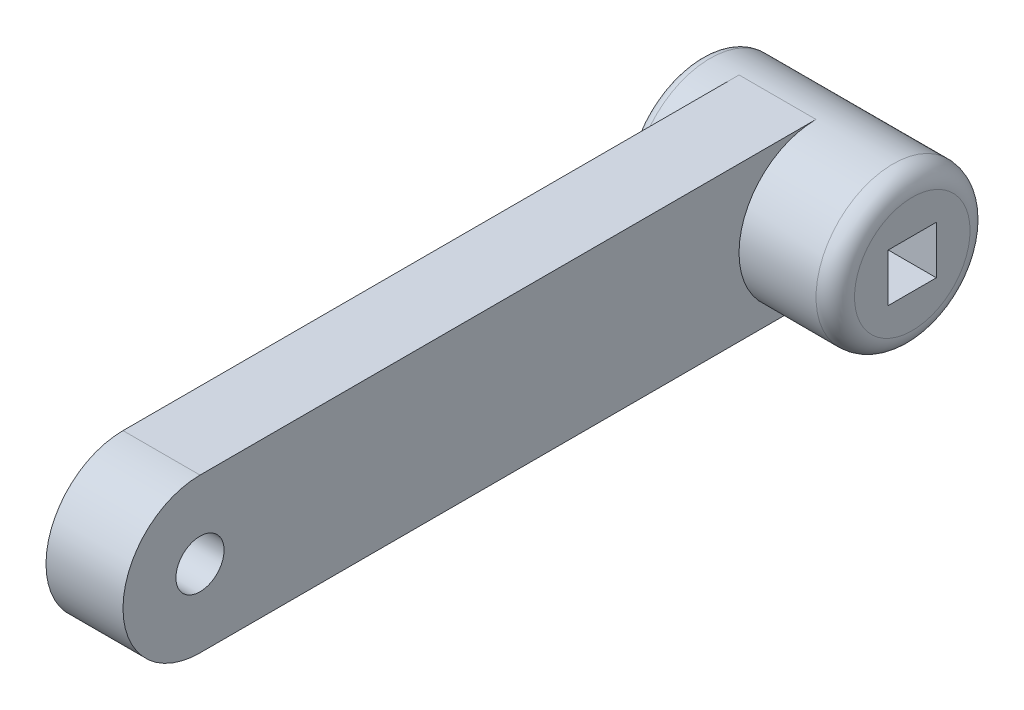
ISO-10303-21;
HEADER;
FILE_DESCRIPTION(('STEP AP214'),'2;1');
FILE_NAME('part.step','',(''),(''),'','','');
FILE_SCHEMA(('AUTOMOTIVE_DESIGN { 1 0 10303 214 1 1 1 1 }'));
ENDSEC;
DATA;
#1=APPLICATION_CONTEXT('core data for automotive mechanical design processes');
#2=APPLICATION_PROTOCOL_DEFINITION('international standard','automotive_design',2000,#1);
#3=PRODUCT_CONTEXT('',#1,'mechanical');
#4=PRODUCT('Part','Part','',(#3));
#5=PRODUCT_RELATED_PRODUCT_CATEGORY('part','',(#4));
#6=PRODUCT_DEFINITION_FORMATION('','',#4);
#7=PRODUCT_DEFINITION_CONTEXT('part definition',#1,'design');
#8=PRODUCT_DEFINITION('design','',#6,#7);
#9=PRODUCT_DEFINITION_SHAPE('','',#8);
#10=(LENGTH_UNIT() NAMED_UNIT(*) SI_UNIT(.MILLI.,.METRE.));
#11=(NAMED_UNIT(*) PLANE_ANGLE_UNIT() SI_UNIT($,.RADIAN.));
#12=(NAMED_UNIT(*) SI_UNIT($,.STERADIAN.) SOLID_ANGLE_UNIT());
#13=UNCERTAINTY_MEASURE_WITH_UNIT(LENGTH_MEASURE(1.E-05),#10,'distance_accuracy_value','');
#14=(GEOMETRIC_REPRESENTATION_CONTEXT(3) GLOBAL_UNCERTAINTY_ASSIGNED_CONTEXT((#13)) GLOBAL_UNIT_ASSIGNED_CONTEXT((#10,
#11,#12)) REPRESENTATION_CONTEXT('',''));
#15=CARTESIAN_POINT('',(0.,0.,0.));
#16=DIRECTION('',(0.,0.,1.));
#17=DIRECTION('',(1.,0.,0.));
#18=AXIS2_PLACEMENT_3D('',#15,#16,#17);
#19=CARTESIAN_POINT('',(10.16,0.,0.));
#20=DIRECTION('',(-1.,0.,0.));
#21=DIRECTION('',(0.,0.,1.));
#22=AXIS2_PLACEMENT_3D('',#19,#20,#21);
#23=CYLINDRICAL_SURFACE('',#22,10.16);
#24=CARTESIAN_POINT('',(15.24,0.,0.));
#25=DIRECTION('',(1.,0.,0.));
#26=DIRECTION('',(0.,0.,-1.));
#27=AXIS2_PLACEMENT_3D('',#24,#25,#26);
#28=CIRCLE('',#27,10.16);
#29=CARTESIAN_POINT('',(15.24,0.,-10.16));
#30=VERTEX_POINT('',#29);
#31=EDGE_CURVE('E11',#30,#30,#28,.F.);
#32=ORIENTED_EDGE('',*,*,#31,.T.);
#33=EDGE_LOOP('',(#32));
#34=FACE_BOUND('',#33,.T.);
#35=CARTESIAN_POINT('',(5.08,0.,0.));
#36=DIRECTION('',(1.,0.,0.));
#37=DIRECTION('',(0.,0.,-1.));
#38=AXIS2_PLACEMENT_3D('',#35,#36,#37);
#39=CIRCLE('',#38,10.16);
#40=CARTESIAN_POINT('',(5.08,10.16,0.));
#41=VERTEX_POINT('',#40);
#42=CARTESIAN_POINT('',(5.08,-10.16,0.));
#43=VERTEX_POINT('',#42);
#44=EDGE_CURVE('E58',#41,#43,#39,.T.);
#45=ORIENTED_EDGE('',*,*,#44,.T.);
#46=DIRECTION('',(-1.,0.,0.));
#47=VECTOR('',#46,1.);
#48=CARTESIAN_POINT('',(5.08,-10.16,0.));
#49=LINE('',#48,#47);
#50=CARTESIAN_POINT('',(-5.08,-10.16,0.));
#51=VERTEX_POINT('',#50);
#52=EDGE_CURVE('E161',#43,#51,#49,.T.);
#53=ORIENTED_EDGE('',*,*,#52,.T.);
#54=CARTESIAN_POINT('',(-5.08,0.,0.));
#55=DIRECTION('',(1.,0.,0.));
#56=DIRECTION('',(0.,0.,-1.));
#57=AXIS2_PLACEMENT_3D('',#54,#55,#56);
#58=CIRCLE('',#57,10.16);
#59=CARTESIAN_POINT('',(-5.08,10.16,0.));
#60=VERTEX_POINT('',#59);
#61=EDGE_CURVE('E172',#60,#51,#58,.T.);
#62=ORIENTED_EDGE('',*,*,#61,.F.);
#63=DIRECTION('',(-1.,0.,0.));
#64=VECTOR('',#63,1.);
#65=CARTESIAN_POINT('',(5.08,10.16,0.));
#66=LINE('',#65,#64);
#67=EDGE_CURVE('E158',#41,#60,#66,.T.);
#68=ORIENTED_EDGE('',*,*,#67,.F.);
#69=EDGE_LOOP('',(#45,#53,#62,#68));
#70=FACE_BOUND('',#69,.T.);
#71=CARTESIAN_POINT('',(-8.89,0.,0.));
#72=DIRECTION('',(1.,0.,0.));
#73=DIRECTION('',(0.,0.,-1.));
#74=AXIS2_PLACEMENT_3D('',#71,#72,#73);
#75=CIRCLE('',#74,10.16);
#76=CARTESIAN_POINT('',(-8.89,0.,-10.16));
#77=VERTEX_POINT('',#76);
#78=EDGE_CURVE('E166',#77,#77,#75,.T.);
#79=ORIENTED_EDGE('',*,*,#78,.T.);
#80=EDGE_LOOP('',(#79));
#81=FACE_BOUND('',#80,.T.);
#82=ADVANCED_FACE('F34',(#34,#70,#81),#23,.T.);
#83=CARTESIAN_POINT('',(-10.16,0.,0.));
#84=DIRECTION('',(1.,0.,0.));
#85=DIRECTION('',(0.,0.,-1.));
#86=AXIS2_PLACEMENT_3D('',#83,#84,#85);
#87=PLANE('',#86);
#88=CARTESIAN_POINT('',(-10.16,0.,0.));
#89=DIRECTION('',(1.,0.,0.));
#90=DIRECTION('',(0.,0.,-1.));
#91=AXIS2_PLACEMENT_3D('',#88,#89,#90);
#92=CIRCLE('',#91,8.89);
#93=CARTESIAN_POINT('',(-10.16,0.,-8.89));
#94=VERTEX_POINT('',#93);
#95=EDGE_CURVE('E169',#94,#94,#92,.F.);
#96=ORIENTED_EDGE('',*,*,#95,.T.);
#97=EDGE_LOOP('',(#96));
#98=FACE_BOUND('',#97,.T.);
#99=ADVANCED_FACE('F194',(#98),#87,.F.);
#100=CARTESIAN_POINT('',(-8.89,0.,0.));
#101=DIRECTION('',(1.,0.,0.));
#102=DIRECTION('',(0.,0.,-1.));
#103=AXIS2_PLACEMENT_3D('',#100,#101,#102);
#104=TOROIDAL_SURFACE('',#103,8.89,1.27);
#105=ORIENTED_EDGE('',*,*,#95,.F.);
#106=EDGE_LOOP('',(#105));
#107=FACE_BOUND('',#106,.T.);
#108=ORIENTED_EDGE('',*,*,#78,.F.);
#109=EDGE_LOOP('',(#108));
#110=FACE_BOUND('',#109,.T.);
#111=ADVANCED_FACE('F200',(#107,#110),#104,.T.);
#112=CARTESIAN_POINT('',(5.08,0.,81.28));
#113=DIRECTION('',(1.,0.,0.));
#114=DIRECTION('',(0.,0.,-1.));
#115=AXIS2_PLACEMENT_3D('',#112,#113,#114);
#116=PLANE('',#115);
#117=CARTESIAN_POINT('',(5.08,0.,81.28));
#118=DIRECTION('',(1.,0.,0.));
#119=DIRECTION('',(0.,0.,-1.));
#120=AXIS2_PLACEMENT_3D('',#117,#118,#119);
#121=CIRCLE('',#120,3.175);
#122=CARTESIAN_POINT('',(5.08,0.,78.105));
#123=VERTEX_POINT('',#122);
#124=EDGE_CURVE('E126',#123,#123,#121,.T.);
#125=ORIENTED_EDGE('',*,*,#124,.F.);
#126=EDGE_LOOP('',(#125));
#127=FACE_BOUND('',#126,.T.);
#128=ORIENTED_EDGE('',*,*,#44,.F.);
#129=DIRECTION('',(0.,0.,1.));
#130=VECTOR('',#129,1.);
#131=CARTESIAN_POINT('',(5.08,10.16,81.28));
#132=LINE('',#131,#130);
#133=CARTESIAN_POINT('',(5.08,10.16,81.28));
#134=VERTEX_POINT('',#133);
#135=EDGE_CURVE('E147',#41,#134,#132,.T.);
#136=ORIENTED_EDGE('',*,*,#135,.T.);
#137=CARTESIAN_POINT('',(5.08,0.,81.28));
#138=DIRECTION('',(1.,0.,0.));
#139=DIRECTION('',(0.,0.,-1.));
#140=AXIS2_PLACEMENT_3D('',#137,#138,#139);
#141=CIRCLE('',#140,10.16);
#142=CARTESIAN_POINT('',(5.08,-10.16,81.28));
#143=VERTEX_POINT('',#142);
#144=EDGE_CURVE('E141',#134,#143,#141,.T.);
#145=ORIENTED_EDGE('',*,*,#144,.T.);
#146=DIRECTION('',(0.,0.,-1.));
#147=VECTOR('',#146,1.);
#148=CARTESIAN_POINT('',(5.08,-10.16,81.28));
#149=LINE('',#148,#147);
#150=EDGE_CURVE('E144',#143,#43,#149,.T.);
#151=ORIENTED_EDGE('',*,*,#150,.T.);
#152=EDGE_LOOP('',(#128,#136,#145,#151));
#153=FACE_BOUND('',#152,.T.);
#154=ADVANCED_FACE('F205',(#127,#153),#116,.T.);
#155=CARTESIAN_POINT('',(-5.08,0.,81.28));
#156=DIRECTION('',(1.,0.,0.));
#157=DIRECTION('',(0.,0.,-1.));
#158=AXIS2_PLACEMENT_3D('',#155,#156,#157);
#159=PLANE('',#158);
#160=CARTESIAN_POINT('',(-5.08,0.,81.28));
#161=DIRECTION('',(1.,0.,0.));
#162=DIRECTION('',(0.,0.,-1.));
#163=AXIS2_PLACEMENT_3D('',#160,#161,#162);
#164=CIRCLE('',#163,3.175);
#165=CARTESIAN_POINT('',(-5.08,0.,78.105));
#166=VERTEX_POINT('',#165);
#167=EDGE_CURVE('E38',#166,#166,#164,.T.);
#168=ORIENTED_EDGE('',*,*,#167,.T.);
#169=EDGE_LOOP('',(#168));
#170=FACE_BOUND('',#169,.T.);
#171=DIRECTION('',(0.,0.,1.));
#172=VECTOR('',#171,1.);
#173=CARTESIAN_POINT('',(-5.08,10.16,81.28));
#174=LINE('',#173,#172);
#175=CARTESIAN_POINT('',(-5.08,10.16,81.28));
#176=VERTEX_POINT('',#175);
#177=EDGE_CURVE('E145',#60,#176,#174,.T.);
#178=ORIENTED_EDGE('',*,*,#177,.F.);
#179=ORIENTED_EDGE('',*,*,#61,.T.);
#180=DIRECTION('',(0.,0.,-1.));
#181=VECTOR('',#180,1.);
#182=CARTESIAN_POINT('',(-5.08,-10.16,81.28));
#183=LINE('',#182,#181);
#184=CARTESIAN_POINT('',(-5.08,-10.16,81.28));
#185=VERTEX_POINT('',#184);
#186=EDGE_CURVE('E152',#185,#51,#183,.T.);
#187=ORIENTED_EDGE('',*,*,#186,.F.);
#188=CARTESIAN_POINT('',(-5.08,0.,81.28));
#189=DIRECTION('',(1.,0.,0.));
#190=DIRECTION('',(0.,0.,-1.));
#191=AXIS2_PLACEMENT_3D('',#188,#189,#190);
#192=CIRCLE('',#191,10.16);
#193=EDGE_CURVE('E137',#176,#185,#192,.T.);
#194=ORIENTED_EDGE('',*,*,#193,.F.);
#195=EDGE_LOOP('',(#178,#179,#187,#194));
#196=FACE_BOUND('',#195,.T.);
#197=ADVANCED_FACE('F210',(#170,#196),#159,.F.);
#198=CARTESIAN_POINT('',(5.08,0.,81.28));
#199=DIRECTION('',(-1.,0.,0.));
#200=DIRECTION('',(0.,0.,1.));
#201=AXIS2_PLACEMENT_3D('',#198,#199,#200);
#202=CYLINDRICAL_SURFACE('',#201,10.16);
#203=ORIENTED_EDGE('',*,*,#193,.T.);
#204=DIRECTION('',(-1.,0.,0.));
#205=VECTOR('',#204,1.);
#206=CARTESIAN_POINT('',(5.08,-10.16,81.28));
#207=LINE('',#206,#205);
#208=EDGE_CURVE('E163',#143,#185,#207,.T.);
#209=ORIENTED_EDGE('',*,*,#208,.F.);
#210=ORIENTED_EDGE('',*,*,#144,.F.);
#211=DIRECTION('',(-1.,0.,0.));
#212=VECTOR('',#211,1.);
#213=CARTESIAN_POINT('',(5.08,10.16,81.28));
#214=LINE('',#213,#212);
#215=EDGE_CURVE('E149',#134,#176,#214,.T.);
#216=ORIENTED_EDGE('',*,*,#215,.T.);
#217=EDGE_LOOP('',(#203,#209,#210,#216));
#218=FACE_BOUND('',#217,.T.);
#219=ADVANCED_FACE('F220',(#218),#202,.T.);
#220=CARTESIAN_POINT('',(5.08,-10.16,81.28));
#221=DIRECTION('',(0.,1.,0.));
#222=DIRECTION('',(0.,0.,1.));
#223=AXIS2_PLACEMENT_3D('',#220,#221,#222);
#224=PLANE('',#223);
#225=ORIENTED_EDGE('',*,*,#186,.T.);
#226=ORIENTED_EDGE('',*,*,#52,.F.);
#227=ORIENTED_EDGE('',*,*,#150,.F.);
#228=ORIENTED_EDGE('',*,*,#208,.T.);
#229=EDGE_LOOP('',(#225,#226,#227,#228));
#230=FACE_BOUND('',#229,.T.);
#231=ADVANCED_FACE('F228',(#230),#224,.F.);
#232=CARTESIAN_POINT('',(5.08,10.16,81.28));
#233=DIRECTION('',(0.,-1.,0.));
#234=DIRECTION('',(0.,0.,-1.));
#235=AXIS2_PLACEMENT_3D('',#232,#233,#234);
#236=PLANE('',#235);
#237=ORIENTED_EDGE('',*,*,#177,.T.);
#238=ORIENTED_EDGE('',*,*,#215,.F.);
#239=ORIENTED_EDGE('',*,*,#135,.F.);
#240=ORIENTED_EDGE('',*,*,#67,.T.);
#241=EDGE_LOOP('',(#237,#238,#239,#240));
#242=FACE_BOUND('',#241,.T.);
#243=ADVANCED_FACE('F189',(#242),#236,.F.);
#244=CARTESIAN_POINT('',(17.78,0.,0.));
#245=DIRECTION('',(1.,0.,0.));
#246=DIRECTION('',(0.,0.,-1.));
#247=AXIS2_PLACEMENT_3D('',#244,#245,#246);
#248=PLANE('',#247);
#249=DIRECTION('',(0.,1.,0.));
#250=VECTOR('',#249,1.);
#251=CARTESIAN_POINT('',(17.78,3.175,-3.175));
#252=LINE('',#251,#250);
#253=CARTESIAN_POINT('',(17.78,-3.175,-3.175));
#254=VERTEX_POINT('',#253);
#255=CARTESIAN_POINT('',(17.78,3.175,-3.175));
#256=VERTEX_POINT('',#255);
#257=EDGE_CURVE('E50',#254,#256,#252,.T.);
#258=ORIENTED_EDGE('',*,*,#257,.F.);
#259=DIRECTION('',(0.,0.,-1.));
#260=VECTOR('',#259,1.);
#261=CARTESIAN_POINT('',(17.78,-3.175,3.175));
#262=LINE('',#261,#260);
#263=CARTESIAN_POINT('',(17.78,-3.175,3.175));
#264=VERTEX_POINT('',#263);
#265=EDGE_CURVE('E120',#264,#254,#262,.T.);
#266=ORIENTED_EDGE('',*,*,#265,.F.);
#267=DIRECTION('',(0.,-1.,0.));
#268=VECTOR('',#267,1.);
#269=CARTESIAN_POINT('',(17.78,3.175,3.175));
#270=LINE('',#269,#268);
#271=CARTESIAN_POINT('',(17.78,3.175,3.175));
#272=VERTEX_POINT('',#271);
#273=EDGE_CURVE('E123',#272,#264,#270,.T.);
#274=ORIENTED_EDGE('',*,*,#273,.F.);
#275=DIRECTION('',(0.,0.,1.));
#276=VECTOR('',#275,1.);
#277=CARTESIAN_POINT('',(17.78,3.175,3.175));
#278=LINE('',#277,#276);
#279=EDGE_CURVE('E131',#256,#272,#278,.T.);
#280=ORIENTED_EDGE('',*,*,#279,.F.);
#281=EDGE_LOOP('',(#258,#266,#274,#280));
#282=FACE_BOUND('',#281,.T.);
#283=CARTESIAN_POINT('',(17.78,0.,0.));
#284=DIRECTION('',(1.,0.,0.));
#285=DIRECTION('',(0.,0.,-1.));
#286=AXIS2_PLACEMENT_3D('',#283,#284,#285);
#287=CIRCLE('',#286,7.62);
#288=CARTESIAN_POINT('',(17.78,0.,-7.62));
#289=VERTEX_POINT('',#288);
#290=EDGE_CURVE('E43',#289,#289,#287,.T.);
#291=ORIENTED_EDGE('',*,*,#290,.T.);
#292=EDGE_LOOP('',(#291));
#293=FACE_BOUND('',#292,.T.);
#294=ADVANCED_FACE('F179',(#282,#293),#248,.T.);
#295=CARTESIAN_POINT('',(15.24,0.,0.));
#296=DIRECTION('',(1.,0.,0.));
#297=DIRECTION('',(0.,0.,-1.));
#298=AXIS2_PLACEMENT_3D('',#295,#296,#297);
#299=TOROIDAL_SURFACE('',#298,7.62,2.54);
#300=ORIENTED_EDGE('',*,*,#31,.F.);
#301=EDGE_LOOP('',(#300));
#302=FACE_BOUND('',#301,.T.);
#303=ORIENTED_EDGE('',*,*,#290,.F.);
#304=EDGE_LOOP('',(#303));
#305=FACE_BOUND('',#304,.T.);
#306=ADVANCED_FACE('F36',(#302,#305),#299,.T.);
#307=CARTESIAN_POINT('',(-7.62,3.175,-3.175));
#308=DIRECTION('',(0.,0.,-1.));
#309=DIRECTION('',(0.,1.,0.));
#310=AXIS2_PLACEMENT_3D('',#307,#308,#309);
#311=PLANE('',#310);
#312=ORIENTED_EDGE('',*,*,#257,.T.);
#313=DIRECTION('',(1.,0.,0.));
#314=VECTOR('',#313,1.);
#315=CARTESIAN_POINT('',(-7.62,3.175,-3.175));
#316=LINE('',#315,#314);
#317=CARTESIAN_POINT('',(-7.62,3.175,-3.175));
#318=VERTEX_POINT('',#317);
#319=EDGE_CURVE('E98',#318,#256,#316,.T.);
#320=ORIENTED_EDGE('',*,*,#319,.F.);
#321=DIRECTION('',(0.,1.,0.));
#322=VECTOR('',#321,1.);
#323=CARTESIAN_POINT('',(-7.62,3.175,-3.175));
#324=LINE('',#323,#322);
#325=CARTESIAN_POINT('',(-7.62,-3.175,-3.175));
#326=VERTEX_POINT('',#325);
#327=EDGE_CURVE('E102',#326,#318,#324,.T.);
#328=ORIENTED_EDGE('',*,*,#327,.F.);
#329=DIRECTION('',(1.,0.,0.));
#330=VECTOR('',#329,1.);
#331=CARTESIAN_POINT('',(-7.62,-3.175,-3.175));
#332=LINE('',#331,#330);
#333=EDGE_CURVE('E135',#326,#254,#332,.T.);
#334=ORIENTED_EDGE('',*,*,#333,.T.);
#335=EDGE_LOOP('',(#312,#320,#328,#334));
#336=FACE_BOUND('',#335,.T.);
#337=ADVANCED_FACE('F100',(#336),#311,.F.);
#338=CARTESIAN_POINT('',(-7.62,-3.175,3.175));
#339=DIRECTION('',(0.,-1.,0.));
#340=DIRECTION('',(0.,0.,-1.));
#341=AXIS2_PLACEMENT_3D('',#338,#339,#340);
#342=PLANE('',#341);
#343=ORIENTED_EDGE('',*,*,#265,.T.);
#344=ORIENTED_EDGE('',*,*,#333,.F.);
#345=DIRECTION('',(0.,0.,-1.));
#346=VECTOR('',#345,1.);
#347=CARTESIAN_POINT('',(-7.62,-3.175,3.175));
#348=LINE('',#347,#346);
#349=CARTESIAN_POINT('',(-7.62,-3.175,3.175));
#350=VERTEX_POINT('',#349);
#351=EDGE_CURVE('E108',#350,#326,#348,.T.);
#352=ORIENTED_EDGE('',*,*,#351,.F.);
#353=DIRECTION('',(1.,0.,0.));
#354=VECTOR('',#353,1.);
#355=CARTESIAN_POINT('',(-7.62,-3.175,3.175));
#356=LINE('',#355,#354);
#357=EDGE_CURVE('E138',#350,#264,#356,.T.);
#358=ORIENTED_EDGE('',*,*,#357,.T.);
#359=EDGE_LOOP('',(#343,#344,#352,#358));
#360=FACE_BOUND('',#359,.T.);
#361=ADVANCED_FACE('F187',(#360),#342,.F.);
#362=CARTESIAN_POINT('',(-7.62,3.175,3.175));
#363=DIRECTION('',(0.,0.,1.));
#364=DIRECTION('',(0.,-1.,0.));
#365=AXIS2_PLACEMENT_3D('',#362,#363,#364);
#366=PLANE('',#365);
#367=ORIENTED_EDGE('',*,*,#273,.T.);
#368=ORIENTED_EDGE('',*,*,#357,.F.);
#369=DIRECTION('',(0.,-1.,0.));
#370=VECTOR('',#369,1.);
#371=CARTESIAN_POINT('',(-7.62,3.175,3.175));
#372=LINE('',#371,#370);
#373=CARTESIAN_POINT('',(-7.62,3.175,3.175));
#374=VERTEX_POINT('',#373);
#375=EDGE_CURVE('E116',#374,#350,#372,.T.);
#376=ORIENTED_EDGE('',*,*,#375,.F.);
#377=DIRECTION('',(1.,0.,0.));
#378=VECTOR('',#377,1.);
#379=CARTESIAN_POINT('',(-7.62,3.175,3.175));
#380=LINE('',#379,#378);
#381=EDGE_CURVE('E107',#374,#272,#380,.T.);
#382=ORIENTED_EDGE('',*,*,#381,.T.);
#383=EDGE_LOOP('',(#367,#368,#376,#382));
#384=FACE_BOUND('',#383,.T.);
#385=ADVANCED_FACE('F278',(#384),#366,.F.);
#386=CARTESIAN_POINT('',(-7.62,3.175,3.175));
#387=DIRECTION('',(0.,1.,0.));
#388=DIRECTION('',(0.,0.,1.));
#389=AXIS2_PLACEMENT_3D('',#386,#387,#388);
#390=PLANE('',#389);
#391=ORIENTED_EDGE('',*,*,#279,.T.);
#392=ORIENTED_EDGE('',*,*,#381,.F.);
#393=DIRECTION('',(0.,0.,1.));
#394=VECTOR('',#393,1.);
#395=CARTESIAN_POINT('',(-7.62,3.175,3.175));
#396=LINE('',#395,#394);
#397=EDGE_CURVE('E111',#318,#374,#396,.T.);
#398=ORIENTED_EDGE('',*,*,#397,.F.);
#399=ORIENTED_EDGE('',*,*,#319,.T.);
#400=EDGE_LOOP('',(#391,#392,#398,#399));
#401=FACE_BOUND('',#400,.T.);
#402=ADVANCED_FACE('F112',(#401),#390,.F.);
#403=CARTESIAN_POINT('',(-7.62,0.,0.));
#404=DIRECTION('',(1.,0.,0.));
#405=DIRECTION('',(0.,0.,-1.));
#406=AXIS2_PLACEMENT_3D('',#403,#404,#405);
#407=PLANE('',#406);
#408=ORIENTED_EDGE('',*,*,#327,.T.);
#409=ORIENTED_EDGE('',*,*,#397,.T.);
#410=ORIENTED_EDGE('',*,*,#375,.T.);
#411=ORIENTED_EDGE('',*,*,#351,.T.);
#412=EDGE_LOOP('',(#408,#409,#410,#411));
#413=FACE_BOUND('',#412,.T.);
#414=ADVANCED_FACE('F118',(#413),#407,.T.);
#415=CARTESIAN_POINT('',(-10.16,0.,81.28));
#416=DIRECTION('',(1.,0.,0.));
#417=DIRECTION('',(0.,0.,-1.));
#418=AXIS2_PLACEMENT_3D('',#415,#416,#417);
#419=CYLINDRICAL_SURFACE('',#418,3.175);
#420=ORIENTED_EDGE('',*,*,#124,.T.);
#421=EDGE_LOOP('',(#420));
#422=FACE_BOUND('',#421,.T.);
#423=ORIENTED_EDGE('',*,*,#167,.F.);
#424=EDGE_LOOP('',(#423));
#425=FACE_BOUND('',#424,.T.);
#426=ADVANCED_FACE('F304',(#422,#425),#419,.F.);
#427=CLOSED_SHELL('',(#82,#99,#111,#154,#197,#219,#231,#243,#294,#306,#337,#361,#385,#402,#414,#426));
#428=MANIFOLD_SOLID_BREP('B2',#427);
#429=ADVANCED_BREP_SHAPE_REPRESENTATION('',(#18,#428),#14);
#430=SHAPE_DEFINITION_REPRESENTATION(#9,#429);
ENDSEC;
END-ISO-10303-21;
